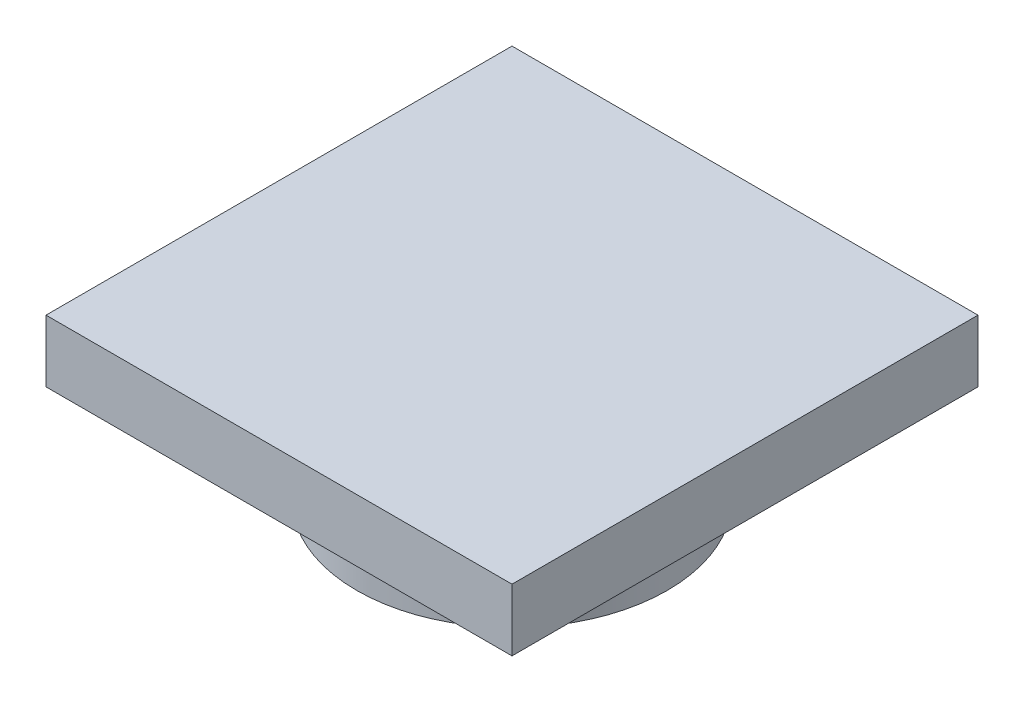
ISO-10303-21;
HEADER;
FILE_DESCRIPTION(('STEP AP214'),'2;1');
FILE_NAME('part.step','',(''),(''),'','','');
FILE_SCHEMA(('AUTOMOTIVE_DESIGN { 1 0 10303 214 1 1 1 1 }'));
ENDSEC;
DATA;
#1=APPLICATION_CONTEXT('core data for automotive mechanical design processes');
#2=APPLICATION_PROTOCOL_DEFINITION('international standard','automotive_design',2000,#1);
#3=PRODUCT_CONTEXT('',#1,'mechanical');
#4=PRODUCT('Part','Part','',(#3));
#5=PRODUCT_RELATED_PRODUCT_CATEGORY('part','',(#4));
#6=PRODUCT_DEFINITION_FORMATION('','',#4);
#7=PRODUCT_DEFINITION_CONTEXT('part definition',#1,'design');
#8=PRODUCT_DEFINITION('design','',#6,#7);
#9=PRODUCT_DEFINITION_SHAPE('','',#8);
#10=(LENGTH_UNIT() NAMED_UNIT(*) SI_UNIT(.MILLI.,.METRE.));
#11=(NAMED_UNIT(*) PLANE_ANGLE_UNIT() SI_UNIT($,.RADIAN.));
#12=(NAMED_UNIT(*) SI_UNIT($,.STERADIAN.) SOLID_ANGLE_UNIT());
#13=UNCERTAINTY_MEASURE_WITH_UNIT(LENGTH_MEASURE(1.E-05),#10,'distance_accuracy_value','');
#14=(GEOMETRIC_REPRESENTATION_CONTEXT(3) GLOBAL_UNCERTAINTY_ASSIGNED_CONTEXT((#13)) GLOBAL_UNIT_ASSIGNED_CONTEXT((#10,
#11,#12)) REPRESENTATION_CONTEXT('',''));
#15=CARTESIAN_POINT('',(0.,0.,0.));
#16=DIRECTION('',(0.,0.,1.));
#17=DIRECTION('',(1.,0.,0.));
#18=AXIS2_PLACEMENT_3D('',#15,#16,#17);
#19=CARTESIAN_POINT('',(0.,3.175,0.));
#20=DIRECTION('',(0.,-1.,0.));
#21=DIRECTION('',(0.,0.,-1.));
#22=AXIS2_PLACEMENT_3D('',#19,#20,#21);
#23=CYLINDRICAL_SURFACE('',#22,5.);
#24=CARTESIAN_POINT('',(0.,3.175,0.));
#25=DIRECTION('',(0.,1.,0.));
#26=DIRECTION('',(0.,0.,1.));
#27=AXIS2_PLACEMENT_3D('',#24,#25,#26);
#28=CIRCLE('',#27,5.);
#29=CARTESIAN_POINT('',(0.,3.175,5.));
#30=VERTEX_POINT('',#29);
#31=EDGE_CURVE('E11',#30,#30,#28,.T.);
#32=ORIENTED_EDGE('',*,*,#31,.F.);
#33=EDGE_LOOP('',(#32));
#34=FACE_BOUND('',#33,.T.);
#35=CARTESIAN_POINT('',(0.,0.,0.));
#36=DIRECTION('',(0.,1.,0.));
#37=DIRECTION('',(0.,0.,1.));
#38=AXIS2_PLACEMENT_3D('',#35,#36,#37);
#39=CIRCLE('',#38,5.);
#40=CARTESIAN_POINT('',(0.,0.,5.));
#41=VERTEX_POINT('',#40);
#42=EDGE_CURVE('E46',#41,#41,#39,.T.);
#43=ORIENTED_EDGE('',*,*,#42,.T.);
#44=EDGE_LOOP('',(#43));
#45=FACE_BOUND('',#44,.T.);
#46=ADVANCED_FACE('F43',(#34,#45),#23,.T.);
#47=CARTESIAN_POINT('',(0.,0.,0.));
#48=DIRECTION('',(0.,1.,0.));
#49=DIRECTION('',(0.,0.,1.));
#50=AXIS2_PLACEMENT_3D('',#47,#48,#49);
#51=PLANE('',#50);
#52=CARTESIAN_POINT('',(0.,0.,0.));
#53=DIRECTION('',(0.,-1.,0.));
#54=DIRECTION('',(0.,0.,-1.));
#55=AXIS2_PLACEMENT_3D('',#52,#53,#54);
#56=CIRCLE('',#55,1.);
#57=CARTESIAN_POINT('',(0.,0.,-1.));
#58=VERTEX_POINT('',#57);
#59=EDGE_CURVE('E119',#58,#58,#56,.T.);
#60=ORIENTED_EDGE('',*,*,#59,.F.);
#61=EDGE_LOOP('',(#60));
#62=FACE_BOUND('',#61,.T.);
#63=ORIENTED_EDGE('',*,*,#42,.F.);
#64=EDGE_LOOP('',(#63));
#65=FACE_BOUND('',#64,.T.);
#66=ADVANCED_FACE('F128',(#62,#65),#51,.F.);
#67=CARTESIAN_POINT('',(0.,3.175,0.));
#68=DIRECTION('',(0.,-1.,0.));
#69=DIRECTION('',(0.,0.,-1.));
#70=AXIS2_PLACEMENT_3D('',#67,#68,#69);
#71=CYLINDRICAL_SURFACE('',#70,1.);
#72=CARTESIAN_POINT('',(0.,3.175,0.));
#73=DIRECTION('',(0.,-1.,0.));
#74=DIRECTION('',(0.,0.,-1.));
#75=AXIS2_PLACEMENT_3D('',#72,#73,#74);
#76=CIRCLE('',#75,1.);
#77=CARTESIAN_POINT('',(0.,3.175,-1.));
#78=VERTEX_POINT('',#77);
#79=EDGE_CURVE('E120',#78,#78,#76,.T.);
#80=ORIENTED_EDGE('',*,*,#79,.F.);
#81=EDGE_LOOP('',(#80));
#82=FACE_BOUND('',#81,.T.);
#83=ORIENTED_EDGE('',*,*,#59,.T.);
#84=EDGE_LOOP('',(#83));
#85=FACE_BOUND('',#84,.T.);
#86=ADVANCED_FACE('F126',(#82,#85),#71,.F.);
#87=CARTESIAN_POINT('',(0.,3.175,0.));
#88=DIRECTION('',(0.,1.,0.));
#89=DIRECTION('',(0.,0.,1.));
#90=AXIS2_PLACEMENT_3D('',#87,#88,#89);
#91=PLANE('',#90);
#92=ORIENTED_EDGE('',*,*,#31,.T.);
#93=EDGE_LOOP('',(#92));
#94=FACE_BOUND('',#93,.T.);
#95=DIRECTION('',(0.,0.,-1.));
#96=VECTOR('',#95,1.);
#97=CARTESIAN_POINT('',(7.5,3.175,-7.5));
#98=LINE('',#97,#96);
#99=CARTESIAN_POINT('',(7.5,3.175,7.5));
#100=VERTEX_POINT('',#99);
#101=CARTESIAN_POINT('',(7.5,3.175,-7.5));
#102=VERTEX_POINT('',#101);
#103=EDGE_CURVE('E110',#100,#102,#98,.T.);
#104=ORIENTED_EDGE('',*,*,#103,.F.);
#105=DIRECTION('',(1.,0.,0.));
#106=VECTOR('',#105,1.);
#107=CARTESIAN_POINT('',(-7.5,3.175,7.5));
#108=LINE('',#107,#106);
#109=CARTESIAN_POINT('',(-7.5,3.175,7.5));
#110=VERTEX_POINT('',#109);
#111=EDGE_CURVE('E82',#110,#100,#108,.T.);
#112=ORIENTED_EDGE('',*,*,#111,.F.);
#113=DIRECTION('',(0.,0.,1.));
#114=VECTOR('',#113,1.);
#115=CARTESIAN_POINT('',(-7.5,3.175,-7.5));
#116=LINE('',#115,#114);
#117=CARTESIAN_POINT('',(-7.5,3.175,-7.5));
#118=VERTEX_POINT('',#117);
#119=EDGE_CURVE('E76',#118,#110,#116,.T.);
#120=ORIENTED_EDGE('',*,*,#119,.F.);
#121=DIRECTION('',(-1.,0.,0.));
#122=VECTOR('',#121,1.);
#123=CARTESIAN_POINT('',(-7.5,3.175,-7.5));
#124=LINE('',#123,#122);
#125=EDGE_CURVE('E100',#102,#118,#124,.T.);
#126=ORIENTED_EDGE('',*,*,#125,.F.);
#127=EDGE_LOOP('',(#104,#112,#120,#126));
#128=FACE_BOUND('',#127,.T.);
#129=ADVANCED_FACE('F140',(#94,#128),#91,.F.);
#130=CARTESIAN_POINT('',(0.,5.175,0.));
#131=DIRECTION('',(0.,1.,0.));
#132=DIRECTION('',(0.,0.,1.));
#133=AXIS2_PLACEMENT_3D('',#130,#131,#132);
#134=PLANE('',#133);
#135=DIRECTION('',(0.,0.,-1.));
#136=VECTOR('',#135,1.);
#137=CARTESIAN_POINT('',(7.5,5.175,-7.5));
#138=LINE('',#137,#136);
#139=CARTESIAN_POINT('',(7.5,5.175,7.5));
#140=VERTEX_POINT('',#139);
#141=CARTESIAN_POINT('',(7.5,5.175,-7.5));
#142=VERTEX_POINT('',#141);
#143=EDGE_CURVE('E95',#140,#142,#138,.T.);
#144=ORIENTED_EDGE('',*,*,#143,.T.);
#145=DIRECTION('',(-1.,0.,0.));
#146=VECTOR('',#145,1.);
#147=CARTESIAN_POINT('',(-7.5,5.175,-7.5));
#148=LINE('',#147,#146);
#149=CARTESIAN_POINT('',(-7.5,5.175,-7.5));
#150=VERTEX_POINT('',#149);
#151=EDGE_CURVE('E90',#142,#150,#148,.T.);
#152=ORIENTED_EDGE('',*,*,#151,.T.);
#153=DIRECTION('',(0.,0.,1.));
#154=VECTOR('',#153,1.);
#155=CARTESIAN_POINT('',(-7.5,5.175,-7.5));
#156=LINE('',#155,#154);
#157=CARTESIAN_POINT('',(-7.5,5.175,7.5));
#158=VERTEX_POINT('',#157);
#159=EDGE_CURVE('E93',#150,#158,#156,.T.);
#160=ORIENTED_EDGE('',*,*,#159,.T.);
#161=DIRECTION('',(1.,0.,0.));
#162=VECTOR('',#161,1.);
#163=CARTESIAN_POINT('',(-7.5,5.175,7.5));
#164=LINE('',#163,#162);
#165=EDGE_CURVE('E59',#158,#140,#164,.T.);
#166=ORIENTED_EDGE('',*,*,#165,.T.);
#167=EDGE_LOOP('',(#144,#152,#160,#166));
#168=FACE_BOUND('',#167,.T.);
#169=ADVANCED_FACE('F91',(#168),#134,.T.);
#170=CARTESIAN_POINT('',(-7.5,5.175,7.5));
#171=DIRECTION('',(0.,0.,-1.));
#172=DIRECTION('',(-1.,0.,0.));
#173=AXIS2_PLACEMENT_3D('',#170,#171,#172);
#174=PLANE('',#173);
#175=ORIENTED_EDGE('',*,*,#111,.T.);
#176=DIRECTION('',(0.,-1.,0.));
#177=VECTOR('',#176,1.);
#178=CARTESIAN_POINT('',(7.5,5.175,7.5));
#179=LINE('',#178,#177);
#180=EDGE_CURVE('E106',#140,#100,#179,.T.);
#181=ORIENTED_EDGE('',*,*,#180,.F.);
#182=ORIENTED_EDGE('',*,*,#165,.F.);
#183=DIRECTION('',(0.,-1.,0.));
#184=VECTOR('',#183,1.);
#185=CARTESIAN_POINT('',(-7.5,5.175,7.5));
#186=LINE('',#185,#184);
#187=EDGE_CURVE('E102',#158,#110,#186,.T.);
#188=ORIENTED_EDGE('',*,*,#187,.T.);
#189=EDGE_LOOP('',(#175,#181,#182,#188));
#190=FACE_BOUND('',#189,.T.);
#191=ADVANCED_FACE('F148',(#190),#174,.F.);
#192=CARTESIAN_POINT('',(-7.5,5.175,-7.5));
#193=DIRECTION('',(1.,0.,0.));
#194=DIRECTION('',(0.,0.,-1.));
#195=AXIS2_PLACEMENT_3D('',#192,#193,#194);
#196=PLANE('',#195);
#197=ORIENTED_EDGE('',*,*,#119,.T.);
#198=ORIENTED_EDGE('',*,*,#187,.F.);
#199=ORIENTED_EDGE('',*,*,#159,.F.);
#200=DIRECTION('',(0.,-1.,0.));
#201=VECTOR('',#200,1.);
#202=CARTESIAN_POINT('',(-7.5,5.175,-7.5));
#203=LINE('',#202,#201);
#204=EDGE_CURVE('E98',#150,#118,#203,.T.);
#205=ORIENTED_EDGE('',*,*,#204,.T.);
#206=EDGE_LOOP('',(#197,#198,#199,#205));
#207=FACE_BOUND('',#206,.T.);
#208=ADVANCED_FACE('F104',(#207),#196,.F.);
#209=CARTESIAN_POINT('',(-7.5,5.175,-7.5));
#210=DIRECTION('',(0.,0.,1.));
#211=DIRECTION('',(1.,0.,0.));
#212=AXIS2_PLACEMENT_3D('',#209,#210,#211);
#213=PLANE('',#212);
#214=ORIENTED_EDGE('',*,*,#125,.T.);
#215=ORIENTED_EDGE('',*,*,#204,.F.);
#216=ORIENTED_EDGE('',*,*,#151,.F.);
#217=DIRECTION('',(0.,-1.,0.));
#218=VECTOR('',#217,1.);
#219=CARTESIAN_POINT('',(7.5,5.175,-7.5));
#220=LINE('',#219,#218);
#221=EDGE_CURVE('E101',#142,#102,#220,.T.);
#222=ORIENTED_EDGE('',*,*,#221,.T.);
#223=EDGE_LOOP('',(#214,#215,#216,#222));
#224=FACE_BOUND('',#223,.T.);
#225=ADVANCED_FACE('F99',(#224),#213,.F.);
#226=CARTESIAN_POINT('',(7.5,5.175,-7.5));
#227=DIRECTION('',(-1.,0.,0.));
#228=DIRECTION('',(0.,0.,1.));
#229=AXIS2_PLACEMENT_3D('',#226,#227,#228);
#230=PLANE('',#229);
#231=ORIENTED_EDGE('',*,*,#103,.T.);
#232=ORIENTED_EDGE('',*,*,#221,.F.);
#233=ORIENTED_EDGE('',*,*,#143,.F.);
#234=ORIENTED_EDGE('',*,*,#180,.T.);
#235=EDGE_LOOP('',(#231,#232,#233,#234));
#236=FACE_BOUND('',#235,.T.);
#237=ADVANCED_FACE('F147',(#236),#230,.F.);
#238=ORIENTED_EDGE('',*,*,#79,.T.);
#239=EDGE_LOOP('',(#238));
#240=FACE_BOUND('',#239,.T.);
#241=ADVANCED_FACE('F144',(#240),#91,.F.);
#242=CLOSED_SHELL('',(#46,#66,#86,#129,#169,#191,#208,#225,#237,#241));
#243=MANIFOLD_SOLID_BREP('B2',#242);
#244=ADVANCED_BREP_SHAPE_REPRESENTATION('',(#18,#243),#14);
#245=SHAPE_DEFINITION_REPRESENTATION(#9,#244);
ENDSEC;
END-ISO-10303-21;
